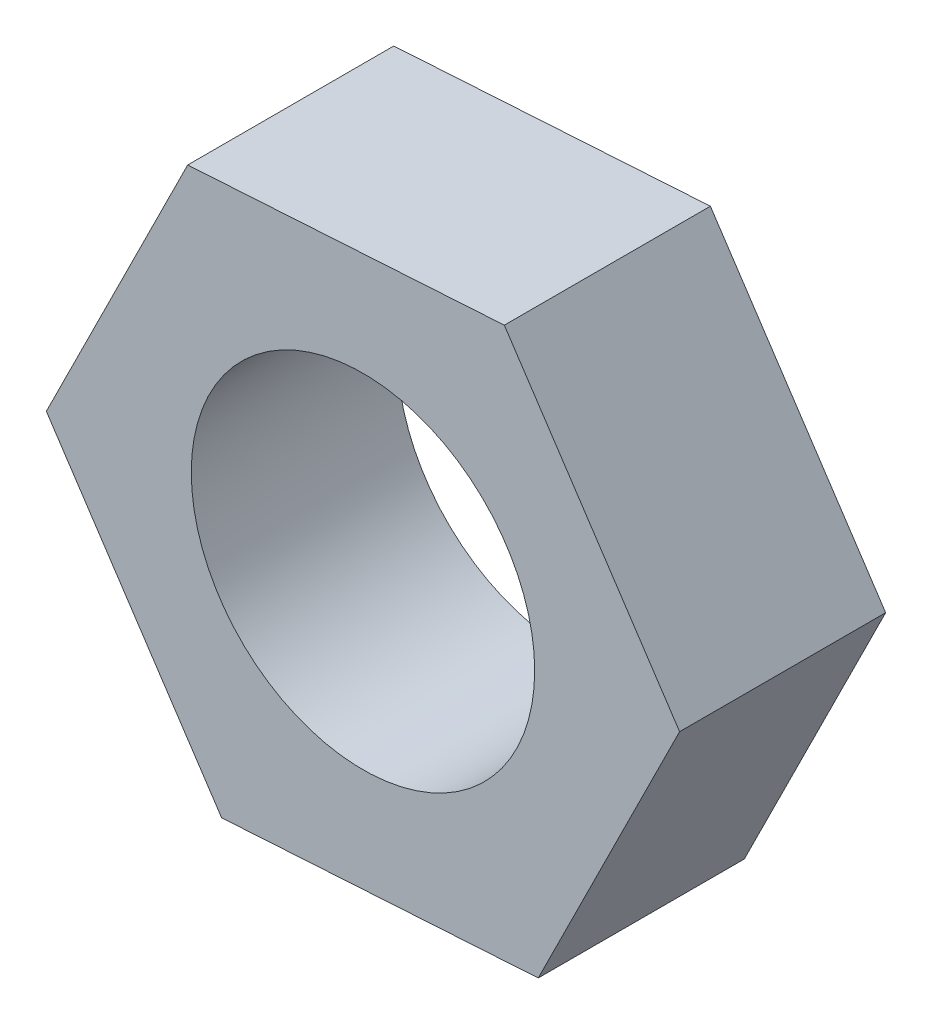
ISO-10303-21;
HEADER;
FILE_DESCRIPTION(('STEP AP214'),'2;1');
FILE_NAME('part.step','',(''),(''),'','','');
FILE_SCHEMA(('AUTOMOTIVE_DESIGN { 1 0 10303 214 1 1 1 1 }'));
ENDSEC;
DATA;
#1=APPLICATION_CONTEXT('core data for automotive mechanical design processes');
#2=APPLICATION_PROTOCOL_DEFINITION('international standard','automotive_design',2000,#1);
#3=PRODUCT_CONTEXT('',#1,'mechanical');
#4=PRODUCT('Part','Part','',(#3));
#5=PRODUCT_RELATED_PRODUCT_CATEGORY('part','',(#4));
#6=PRODUCT_DEFINITION_FORMATION('','',#4);
#7=PRODUCT_DEFINITION_CONTEXT('part definition',#1,'design');
#8=PRODUCT_DEFINITION('design','',#6,#7);
#9=PRODUCT_DEFINITION_SHAPE('','',#8);
#10=(LENGTH_UNIT() NAMED_UNIT(*) SI_UNIT(.MILLI.,.METRE.));
#11=(NAMED_UNIT(*) PLANE_ANGLE_UNIT() SI_UNIT($,.RADIAN.));
#12=(NAMED_UNIT(*) SI_UNIT($,.STERADIAN.) SOLID_ANGLE_UNIT());
#13=UNCERTAINTY_MEASURE_WITH_UNIT(LENGTH_MEASURE(1.E-05),#10,'distance_accuracy_value','');
#14=(GEOMETRIC_REPRESENTATION_CONTEXT(3) GLOBAL_UNCERTAINTY_ASSIGNED_CONTEXT((#13)) GLOBAL_UNIT_ASSIGNED_CONTEXT((#10,
#11,#12)) REPRESENTATION_CONTEXT('',''));
#15=CARTESIAN_POINT('',(0.,0.,0.));
#16=DIRECTION('',(0.,0.,1.));
#17=DIRECTION('',(1.,0.,0.));
#18=AXIS2_PLACEMENT_3D('',#15,#16,#17);
#19=CARTESIAN_POINT('',(4.60999145111421,0.28515286073837,3.));
#20=DIRECTION('',(-0.83350469441376,-0.552512374875193,0.));
#21=DIRECTION('',(0.552512374875193,-0.83350469441376,0.));
#22=AXIS2_PLACEMENT_3D('',#19,#20,#21);
#23=PLANE('',#22);
#24=DIRECTION('',(-0.552512374875193,0.83350469441376,0.));
#25=VECTOR('',#24,1.);
#26=CARTESIAN_POINT('',(4.60999145111421,0.28515286073837,0.));
#27=LINE('',#26,#25);
#28=CARTESIAN_POINT('',(4.60999145111421,0.28515286073837,0.));
#29=VERTEX_POINT('',#28);
#30=CARTESIAN_POINT('',(2.05804610419587,4.13494613826318,0.));
#31=VERTEX_POINT('',#30);
#32=EDGE_CURVE('E117',#29,#31,#27,.T.);
#33=ORIENTED_EDGE('',*,*,#32,.T.);
#34=DIRECTION('',(0.,0.,-1.));
#35=VECTOR('',#34,1.);
#36=CARTESIAN_POINT('',(2.05804610419587,4.13494613826318,3.));
#37=LINE('',#36,#35);
#38=CARTESIAN_POINT('',(2.05804610419587,4.13494613826318,3.));
#39=VERTEX_POINT('',#38);
#40=EDGE_CURVE('E11',#39,#31,#37,.T.);
#41=ORIENTED_EDGE('',*,*,#40,.F.);
#42=DIRECTION('',(-0.552512374875193,0.83350469441376,0.));
#43=VECTOR('',#42,1.);
#44=CARTESIAN_POINT('',(4.60999145111421,0.28515286073837,3.));
#45=LINE('',#44,#43);
#46=CARTESIAN_POINT('',(4.60999145111421,0.28515286073837,3.));
#47=VERTEX_POINT('',#46);
#48=EDGE_CURVE('E128',#47,#39,#45,.T.);
#49=ORIENTED_EDGE('',*,*,#48,.F.);
#50=DIRECTION('',(0.,0.,-1.));
#51=VECTOR('',#50,1.);
#52=CARTESIAN_POINT('',(4.60999145111421,0.28515286073837,3.));
#53=LINE('',#52,#51);
#54=EDGE_CURVE('E113',#47,#29,#53,.T.);
#55=ORIENTED_EDGE('',*,*,#54,.T.);
#56=EDGE_LOOP('',(#33,#41,#49,#55));
#57=FACE_BOUND('',#56,.T.);
#58=ADVANCED_FACE('F33',(#57),#23,.F.);
#59=CARTESIAN_POINT('',(2.05804610419587,4.13494613826318,3.));
#60=DIRECTION('',(0.0617374053403082,-0.998092426973498,0.));
#61=DIRECTION('',(0.998092426973498,0.0617374053403082,0.));
#62=AXIS2_PLACEMENT_3D('',#59,#60,#61);
#63=PLANE('',#62);
#64=DIRECTION('',(-0.998092426973498,-0.0617374053403082,0.));
#65=VECTOR('',#64,1.);
#66=CARTESIAN_POINT('',(2.05804610419587,4.13494613826318,0.));
#67=LINE('',#66,#65);
#68=CARTESIAN_POINT('',(-2.55194534691834,3.84979327752481,0.));
#69=VERTEX_POINT('',#68);
#70=EDGE_CURVE('E120',#31,#69,#67,.T.);
#71=ORIENTED_EDGE('',*,*,#70,.T.);
#72=DIRECTION('',(0.,0.,-1.));
#73=VECTOR('',#72,1.);
#74=CARTESIAN_POINT('',(-2.55194534691834,3.84979327752481,3.));
#75=LINE('',#74,#73);
#76=CARTESIAN_POINT('',(-2.55194534691834,3.84979327752481,3.));
#77=VERTEX_POINT('',#76);
#78=EDGE_CURVE('E41',#77,#69,#75,.T.);
#79=ORIENTED_EDGE('',*,*,#78,.F.);
#80=DIRECTION('',(-0.998092426973498,-0.0617374053403082,0.));
#81=VECTOR('',#80,1.);
#82=CARTESIAN_POINT('',(2.05804610419587,4.13494613826318,3.));
#83=LINE('',#82,#81);
#84=EDGE_CURVE('E86',#39,#77,#83,.T.);
#85=ORIENTED_EDGE('',*,*,#84,.F.);
#86=ORIENTED_EDGE('',*,*,#40,.T.);
#87=EDGE_LOOP('',(#71,#79,#85,#86));
#88=FACE_BOUND('',#87,.T.);
#89=ADVANCED_FACE('F153',(#88),#63,.F.);
#90=CARTESIAN_POINT('',(-2.55194534691834,3.84979327752481,3.));
#91=DIRECTION('',(0.895242099754068,-0.445580052098305,0.));
#92=DIRECTION('',(0.445580052098305,0.895242099754068,0.));
#93=AXIS2_PLACEMENT_3D('',#90,#91,#92);
#94=PLANE('',#93);
#95=DIRECTION('',(-0.445580052098305,-0.895242099754068,0.));
#96=VECTOR('',#95,1.);
#97=CARTESIAN_POINT('',(-2.55194534691834,3.84979327752481,0.));
#98=LINE('',#97,#96);
#99=CARTESIAN_POINT('',(-4.60999145111421,-0.285152860738367,0.));
#100=VERTEX_POINT('',#99);
#101=EDGE_CURVE('E123',#69,#100,#98,.T.);
#102=ORIENTED_EDGE('',*,*,#101,.T.);
#103=DIRECTION('',(0.,0.,-1.));
#104=VECTOR('',#103,1.);
#105=CARTESIAN_POINT('',(-4.60999145111421,-0.285152860738367,3.));
#106=LINE('',#105,#104);
#107=CARTESIAN_POINT('',(-4.60999145111421,-0.285152860738367,3.));
#108=VERTEX_POINT('',#107);
#109=EDGE_CURVE('E108',#108,#100,#106,.T.);
#110=ORIENTED_EDGE('',*,*,#109,.F.);
#111=DIRECTION('',(-0.445580052098305,-0.895242099754068,0.));
#112=VECTOR('',#111,1.);
#113=CARTESIAN_POINT('',(-2.55194534691834,3.84979327752481,3.));
#114=LINE('',#113,#112);
#115=EDGE_CURVE('E99',#77,#108,#114,.T.);
#116=ORIENTED_EDGE('',*,*,#115,.F.);
#117=ORIENTED_EDGE('',*,*,#78,.T.);
#118=EDGE_LOOP('',(#102,#110,#116,#117));
#119=FACE_BOUND('',#118,.T.);
#120=ADVANCED_FACE('F134',(#119),#94,.F.);
#121=CARTESIAN_POINT('',(-4.60999145111421,-0.285152860738367,3.));
#122=DIRECTION('',(0.833504694413759,0.552512374875193,0.));
#123=DIRECTION('',(-0.552512374875193,0.83350469441376,0.));
#124=AXIS2_PLACEMENT_3D('',#121,#122,#123);
#125=PLANE('',#124);
#126=DIRECTION('',(0.552512374875193,-0.833504694413759,0.));
#127=VECTOR('',#126,1.);
#128=CARTESIAN_POINT('',(-4.60999145111421,-0.285152860738367,0.));
#129=LINE('',#128,#127);
#130=CARTESIAN_POINT('',(-2.05804610419587,-4.13494613826318,0.));
#131=VERTEX_POINT('',#130);
#132=EDGE_CURVE('E107',#100,#131,#129,.T.);
#133=ORIENTED_EDGE('',*,*,#132,.T.);
#134=DIRECTION('',(0.,0.,-1.));
#135=VECTOR('',#134,1.);
#136=CARTESIAN_POINT('',(-2.05804610419587,-4.13494613826318,3.));
#137=LINE('',#136,#135);
#138=CARTESIAN_POINT('',(-2.05804610419587,-4.13494613826318,3.));
#139=VERTEX_POINT('',#138);
#140=EDGE_CURVE('E104',#139,#131,#137,.T.);
#141=ORIENTED_EDGE('',*,*,#140,.F.);
#142=DIRECTION('',(0.552512374875193,-0.833504694413759,0.));
#143=VECTOR('',#142,1.);
#144=CARTESIAN_POINT('',(-4.60999145111421,-0.285152860738367,3.));
#145=LINE('',#144,#143);
#146=EDGE_CURVE('E93',#108,#139,#145,.T.);
#147=ORIENTED_EDGE('',*,*,#146,.F.);
#148=ORIENTED_EDGE('',*,*,#109,.T.);
#149=EDGE_LOOP('',(#133,#141,#147,#148));
#150=FACE_BOUND('',#149,.T.);
#151=ADVANCED_FACE('F105',(#150),#125,.F.);
#152=CARTESIAN_POINT('',(-2.05804610419587,-4.13494613826318,3.));
#153=DIRECTION('',(-0.0617374053403083,0.998092426973498,0.));
#154=DIRECTION('',(-0.998092426973498,-0.0617374053403083,0.));
#155=AXIS2_PLACEMENT_3D('',#152,#153,#154);
#156=PLANE('',#155);
#157=DIRECTION('',(0.998092426973498,0.0617374053403083,0.));
#158=VECTOR('',#157,1.);
#159=CARTESIAN_POINT('',(-2.05804610419587,-4.13494613826318,0.));
#160=LINE('',#159,#158);
#161=CARTESIAN_POINT('',(2.55194534691834,-3.84979327752481,0.));
#162=VERTEX_POINT('',#161);
#163=EDGE_CURVE('E72',#131,#162,#160,.T.);
#164=ORIENTED_EDGE('',*,*,#163,.T.);
#165=DIRECTION('',(0.,0.,-1.));
#166=VECTOR('',#165,1.);
#167=CARTESIAN_POINT('',(2.55194534691834,-3.84979327752481,3.));
#168=LINE('',#167,#166);
#169=CARTESIAN_POINT('',(2.55194534691834,-3.84979327752481,3.));
#170=VERTEX_POINT('',#169);
#171=EDGE_CURVE('E109',#170,#162,#168,.T.);
#172=ORIENTED_EDGE('',*,*,#171,.F.);
#173=DIRECTION('',(0.998092426973498,0.0617374053403083,0.));
#174=VECTOR('',#173,1.);
#175=CARTESIAN_POINT('',(-2.05804610419587,-4.13494613826318,3.));
#176=LINE('',#175,#174);
#177=EDGE_CURVE('E97',#139,#170,#176,.T.);
#178=ORIENTED_EDGE('',*,*,#177,.F.);
#179=ORIENTED_EDGE('',*,*,#140,.T.);
#180=EDGE_LOOP('',(#164,#172,#178,#179));
#181=FACE_BOUND('',#180,.T.);
#182=ADVANCED_FACE('F111',(#181),#156,.F.);
#183=CARTESIAN_POINT('',(2.55194534691834,-3.84979327752481,3.));
#184=DIRECTION('',(-0.895242099754068,0.445580052098305,0.));
#185=DIRECTION('',(-0.445580052098305,-0.895242099754068,0.));
#186=AXIS2_PLACEMENT_3D('',#183,#184,#185);
#187=PLANE('',#186);
#188=DIRECTION('',(0.445580052098305,0.895242099754068,0.));
#189=VECTOR('',#188,1.);
#190=CARTESIAN_POINT('',(2.55194534691834,-3.84979327752481,0.));
#191=LINE('',#190,#189);
#192=EDGE_CURVE('E78',#162,#29,#191,.T.);
#193=ORIENTED_EDGE('',*,*,#192,.T.);
#194=ORIENTED_EDGE('',*,*,#54,.F.);
#195=DIRECTION('',(0.445580052098305,0.895242099754068,0.));
#196=VECTOR('',#195,1.);
#197=CARTESIAN_POINT('',(2.55194534691834,-3.84979327752481,3.));
#198=LINE('',#197,#196);
#199=EDGE_CURVE('E49',#170,#47,#198,.T.);
#200=ORIENTED_EDGE('',*,*,#199,.F.);
#201=ORIENTED_EDGE('',*,*,#171,.T.);
#202=EDGE_LOOP('',(#193,#194,#200,#201));
#203=FACE_BOUND('',#202,.T.);
#204=ADVANCED_FACE('F141',(#203),#187,.F.);
#205=CARTESIAN_POINT('',(0.,0.,3.));
#206=DIRECTION('',(0.,0.,1.));
#207=DIRECTION('',(1.,0.,0.));
#208=AXIS2_PLACEMENT_3D('',#205,#206,#207);
#209=PLANE('',#208);
#210=CARTESIAN_POINT('',(0.,0.,3.));
#211=DIRECTION('',(0.,0.,1.));
#212=DIRECTION('',(1.,0.,0.));
#213=AXIS2_PLACEMENT_3D('',#210,#211,#212);
#214=CIRCLE('',#213,2.5);
#215=CARTESIAN_POINT('',(2.5,0.,3.));
#216=VERTEX_POINT('',#215);
#217=EDGE_CURVE('E206',#216,#216,#214,.T.);
#218=ORIENTED_EDGE('',*,*,#217,.F.);
#219=EDGE_LOOP('',(#218));
#220=FACE_BOUND('',#219,.T.);
#221=ORIENTED_EDGE('',*,*,#48,.T.);
#222=ORIENTED_EDGE('',*,*,#84,.T.);
#223=ORIENTED_EDGE('',*,*,#115,.T.);
#224=ORIENTED_EDGE('',*,*,#146,.T.);
#225=ORIENTED_EDGE('',*,*,#177,.T.);
#226=ORIENTED_EDGE('',*,*,#199,.T.);
#227=EDGE_LOOP('',(#221,#222,#223,#224,#225,#226));
#228=FACE_BOUND('',#227,.T.);
#229=ADVANCED_FACE('F95',(#220,#228),#209,.T.);
#230=CARTESIAN_POINT('',(0.,0.,0.));
#231=DIRECTION('',(0.,0.,1.));
#232=DIRECTION('',(1.,0.,0.));
#233=AXIS2_PLACEMENT_3D('',#230,#231,#232);
#234=PLANE('',#233);
#235=CARTESIAN_POINT('',(0.,0.,0.));
#236=DIRECTION('',(0.,0.,1.));
#237=DIRECTION('',(1.,0.,0.));
#238=AXIS2_PLACEMENT_3D('',#235,#236,#237);
#239=CIRCLE('',#238,2.5);
#240=CARTESIAN_POINT('',(2.5,0.,0.));
#241=VERTEX_POINT('',#240);
#242=EDGE_CURVE('E121',#241,#241,#239,.F.);
#243=ORIENTED_EDGE('',*,*,#242,.F.);
#244=EDGE_LOOP('',(#243));
#245=FACE_BOUND('',#244,.T.);
#246=ORIENTED_EDGE('',*,*,#32,.F.);
#247=ORIENTED_EDGE('',*,*,#192,.F.);
#248=ORIENTED_EDGE('',*,*,#163,.F.);
#249=ORIENTED_EDGE('',*,*,#132,.F.);
#250=ORIENTED_EDGE('',*,*,#101,.F.);
#251=ORIENTED_EDGE('',*,*,#70,.F.);
#252=EDGE_LOOP('',(#246,#247,#248,#249,#250,#251));
#253=FACE_BOUND('',#252,.T.);
#254=ADVANCED_FACE('F137',(#245,#253),#234,.F.);
#255=CARTESIAN_POINT('',(0.,0.,-0.00100000000000013));
#256=DIRECTION('',(0.,0.,1.));
#257=DIRECTION('',(1.,0.,0.));
#258=AXIS2_PLACEMENT_3D('',#255,#256,#257);
#259=CYLINDRICAL_SURFACE('',#258,2.5);
#260=ORIENTED_EDGE('',*,*,#217,.T.);
#261=EDGE_LOOP('',(#260));
#262=FACE_BOUND('',#261,.T.);
#263=ORIENTED_EDGE('',*,*,#242,.T.);
#264=EDGE_LOOP('',(#263));
#265=FACE_BOUND('',#264,.T.);
#266=ADVANCED_FACE('F190',(#262,#265),#259,.F.);
#267=CLOSED_SHELL('',(#58,#89,#120,#151,#182,#204,#229,#254,#266));
#268=MANIFOLD_SOLID_BREP('B2',#267);
#269=ADVANCED_BREP_SHAPE_REPRESENTATION('',(#18,#268),#14);
#270=SHAPE_DEFINITION_REPRESENTATION(#9,#269);
ENDSEC;
END-ISO-10303-21;
